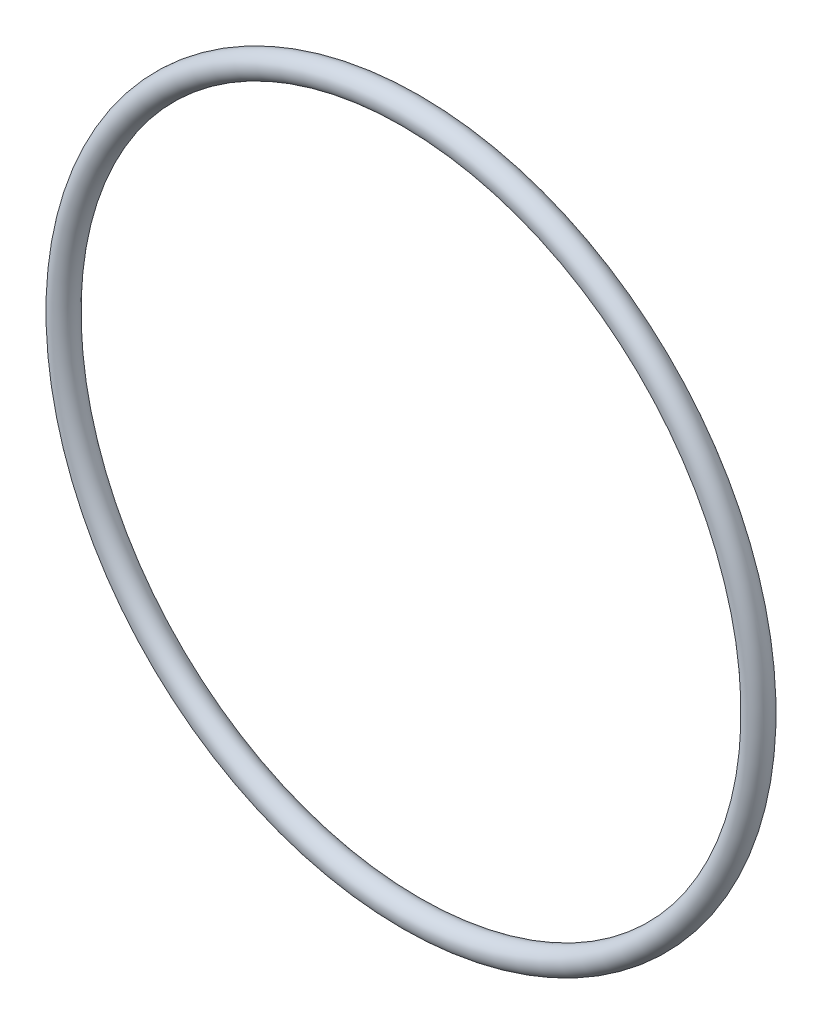
ISO-10303-21;
HEADER;
FILE_DESCRIPTION(('STEP AP214'),'2;1');
FILE_NAME('part.step','',(''),(''),'','','');
FILE_SCHEMA(('AUTOMOTIVE_DESIGN { 1 0 10303 214 1 1 1 1 }'));
ENDSEC;
DATA;
#1=APPLICATION_CONTEXT('core data for automotive mechanical design processes');
#2=APPLICATION_PROTOCOL_DEFINITION('international standard','automotive_design',2000,#1);
#3=PRODUCT_CONTEXT('',#1,'mechanical');
#4=PRODUCT('Part','Part','',(#3));
#5=PRODUCT_RELATED_PRODUCT_CATEGORY('part','',(#4));
#6=PRODUCT_DEFINITION_FORMATION('','',#4);
#7=PRODUCT_DEFINITION_CONTEXT('part definition',#1,'design');
#8=PRODUCT_DEFINITION('design','',#6,#7);
#9=PRODUCT_DEFINITION_SHAPE('','',#8);
#10=(LENGTH_UNIT() NAMED_UNIT(*) SI_UNIT(.MILLI.,.METRE.));
#11=(NAMED_UNIT(*) PLANE_ANGLE_UNIT() SI_UNIT($,.RADIAN.));
#12=(NAMED_UNIT(*) SI_UNIT($,.STERADIAN.) SOLID_ANGLE_UNIT());
#13=UNCERTAINTY_MEASURE_WITH_UNIT(LENGTH_MEASURE(1.E-05),#10,'distance_accuracy_value','');
#14=(GEOMETRIC_REPRESENTATION_CONTEXT(3) GLOBAL_UNCERTAINTY_ASSIGNED_CONTEXT((#13)) GLOBAL_UNIT_ASSIGNED_CONTEXT((#10,
#11,#12)) REPRESENTATION_CONTEXT('',''));
#15=CARTESIAN_POINT('',(0.,0.,0.));
#16=DIRECTION('',(0.,0.,1.));
#17=DIRECTION('',(1.,0.,0.));
#18=AXIS2_PLACEMENT_3D('',#15,#16,#17);
#19=CARTESIAN_POINT('',(0.,0.,1.3));
#20=DIRECTION('',(0.,0.,-1.));
#21=DIRECTION('',(0.,1.,0.));
#22=AXIS2_PLACEMENT_3D('',#19,#20,#21);
#23=TOROIDAL_SURFACE('',#22,1.4,0.0499999999999999);
#24=CARTESIAN_POINT('',(0.,1.45,1.3));
#25=VERTEX_POINT('',#24);
#26=VERTEX_LOOP('',#25);
#27=FACE_BOUND('',#26,.T.);
#28=ADVANCED_FACE('F13',(#27),#23,.T.);
#29=CLOSED_SHELL('',(#28));
#30=MANIFOLD_SOLID_BREP('B1',#29);
#31=ADVANCED_BREP_SHAPE_REPRESENTATION('',(#18,#30),#14);
#32=SHAPE_DEFINITION_REPRESENTATION(#9,#31);
ENDSEC;
END-ISO-10303-21;
